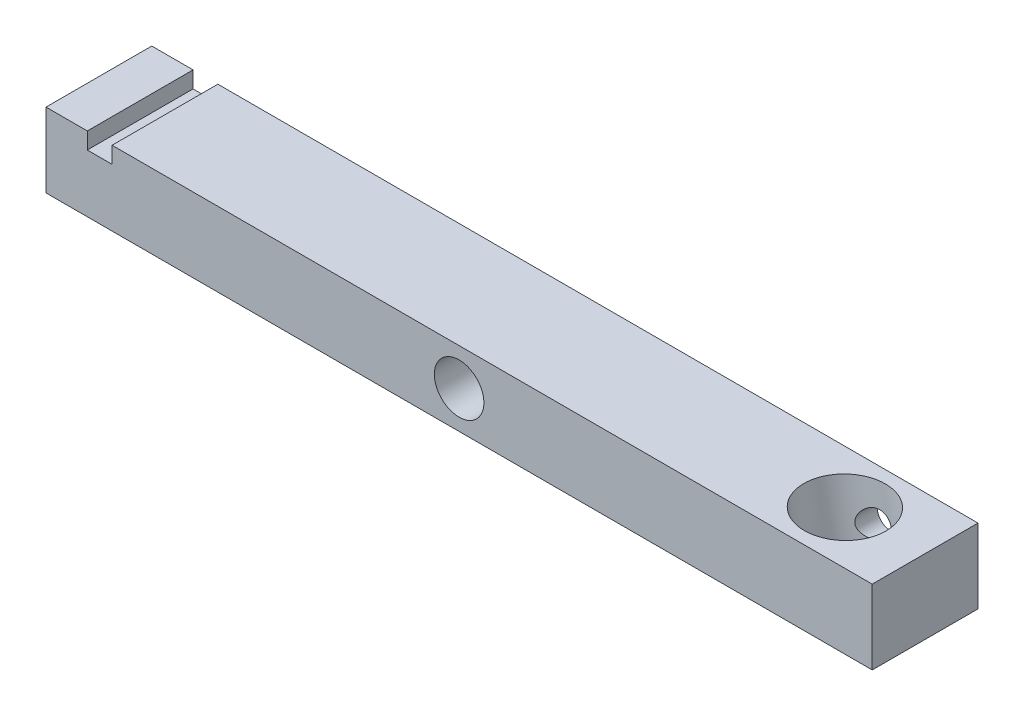
ISO-10303-21;
HEADER;
FILE_DESCRIPTION(('STEP AP214'),'2;1');
FILE_NAME('part.step','',(''),(''),'','','');
FILE_SCHEMA(('AUTOMOTIVE_DESIGN { 1 0 10303 214 1 1 1 1 }'));
ENDSEC;
DATA;
#1=APPLICATION_CONTEXT('core data for automotive mechanical design processes');
#2=APPLICATION_PROTOCOL_DEFINITION('international standard','automotive_design',2000,#1);
#3=PRODUCT_CONTEXT('',#1,'mechanical');
#4=PRODUCT('Part','Part','',(#3));
#5=PRODUCT_RELATED_PRODUCT_CATEGORY('part','',(#4));
#6=PRODUCT_DEFINITION_FORMATION('','',#4);
#7=PRODUCT_DEFINITION_CONTEXT('part definition',#1,'design');
#8=PRODUCT_DEFINITION('design','',#6,#7);
#9=PRODUCT_DEFINITION_SHAPE('','',#8);
#10=(LENGTH_UNIT() NAMED_UNIT(*) SI_UNIT(.MILLI.,.METRE.));
#11=(NAMED_UNIT(*) PLANE_ANGLE_UNIT() SI_UNIT($,.RADIAN.));
#12=(NAMED_UNIT(*) SI_UNIT($,.STERADIAN.) SOLID_ANGLE_UNIT());
#13=UNCERTAINTY_MEASURE_WITH_UNIT(LENGTH_MEASURE(1.E-05),#10,'distance_accuracy_value','');
#14=(GEOMETRIC_REPRESENTATION_CONTEXT(3) GLOBAL_UNCERTAINTY_ASSIGNED_CONTEXT((#13)) GLOBAL_UNIT_ASSIGNED_CONTEXT((#10,
#11,#12)) REPRESENTATION_CONTEXT('',''));
#15=CARTESIAN_POINT('',(0.,0.,0.));
#16=DIRECTION('',(0.,0.,1.));
#17=DIRECTION('',(1.,0.,0.));
#18=AXIS2_PLACEMENT_3D('',#15,#16,#17);
#19=CARTESIAN_POINT('',(-63.5,5.715,8.128));
#20=DIRECTION('',(0.,-1.,0.));
#21=DIRECTION('',(0.,0.,-1.));
#22=AXIS2_PLACEMENT_3D('',#19,#20,#21);
#23=PLANE('',#22);
#24=CARTESIAN_POINT('',(51.1678482337431,5.715,0.));
#25=DIRECTION('',(0.,-1.,0.));
#26=DIRECTION('',(1.,0.,0.));
#27=AXIS2_PLACEMENT_3D('',#24,#25,#26);
#28=ELLIPSE('',#27,6.31899980576499,6.223);
#29=CARTESIAN_POINT('',(57.4868480395081,5.715,0.));
#30=VERTEX_POINT('',#29);
#31=EDGE_CURVE('E239',#30,#30,#28,.T.);
#32=ORIENTED_EDGE('',*,*,#31,.T.);
#33=EDGE_LOOP('',(#32));
#34=FACE_BOUND('',#33,.T.);
#35=DIRECTION('',(-1.,0.,0.));
#36=VECTOR('',#35,1.);
#37=CARTESIAN_POINT('',(-63.5,5.715,-8.128));
#38=LINE('',#37,#36);
#39=CARTESIAN_POINT('',(63.5,5.715,-8.128));
#40=VERTEX_POINT('',#39);
#41=CARTESIAN_POINT('',(-53.34,5.715,-8.128));
#42=VERTEX_POINT('',#41);
#43=EDGE_CURVE('E173',#40,#42,#38,.T.);
#44=ORIENTED_EDGE('',*,*,#43,.T.);
#45=DIRECTION('',(0.,0.,1.));
#46=VECTOR('',#45,1.);
#47=CARTESIAN_POINT('',(-53.34,5.715,-12.7070501198393));
#48=LINE('',#47,#46);
#49=CARTESIAN_POINT('',(-53.34,5.715,8.128));
#50=VERTEX_POINT('',#49);
#51=EDGE_CURVE('E120',#42,#50,#48,.T.);
#52=ORIENTED_EDGE('',*,*,#51,.T.);
#53=DIRECTION('',(-1.,0.,0.));
#54=VECTOR('',#53,1.);
#55=CARTESIAN_POINT('',(-63.5,5.715,8.128));
#56=LINE('',#55,#54);
#57=CARTESIAN_POINT('',(63.5,5.715,8.128));
#58=VERTEX_POINT('',#57);
#59=EDGE_CURVE('E93',#58,#50,#56,.T.);
#60=ORIENTED_EDGE('',*,*,#59,.F.);
#61=DIRECTION('',(0.,0.,-1.));
#62=VECTOR('',#61,1.);
#63=CARTESIAN_POINT('',(63.5,5.715,8.128));
#64=LINE('',#63,#62);
#65=EDGE_CURVE('E11',#58,#40,#64,.T.);
#66=ORIENTED_EDGE('',*,*,#65,.T.);
#67=EDGE_LOOP('',(#44,#52,#60,#66));
#68=FACE_BOUND('',#67,.T.);
#69=ADVANCED_FACE('F39',(#34,#68),#23,.F.);
#70=CARTESIAN_POINT('',(63.5,-5.715,8.128));
#71=DIRECTION('',(-1.,0.,0.));
#72=DIRECTION('',(0.,0.,1.));
#73=AXIS2_PLACEMENT_3D('',#70,#71,#72);
#74=PLANE('',#73);
#75=DIRECTION('',(0.,1.,0.));
#76=VECTOR('',#75,1.);
#77=CARTESIAN_POINT('',(63.5,-5.715,-8.128));
#78=LINE('',#77,#76);
#79=CARTESIAN_POINT('',(63.5,-5.715,-8.128));
#80=VERTEX_POINT('',#79);
#81=EDGE_CURVE('E156',#80,#40,#78,.T.);
#82=ORIENTED_EDGE('',*,*,#81,.T.);
#83=ORIENTED_EDGE('',*,*,#65,.F.);
#84=DIRECTION('',(0.,1.,0.));
#85=VECTOR('',#84,1.);
#86=CARTESIAN_POINT('',(63.5,-5.715,8.128));
#87=LINE('',#86,#85);
#88=CARTESIAN_POINT('',(63.5,-5.715,8.128));
#89=VERTEX_POINT('',#88);
#90=EDGE_CURVE('E157',#89,#58,#87,.T.);
#91=ORIENTED_EDGE('',*,*,#90,.F.);
#92=DIRECTION('',(0.,0.,-1.));
#93=VECTOR('',#92,1.);
#94=CARTESIAN_POINT('',(63.5,-5.715,8.128));
#95=LINE('',#94,#93);
#96=EDGE_CURVE('E168',#89,#80,#95,.T.);
#97=ORIENTED_EDGE('',*,*,#96,.T.);
#98=EDGE_LOOP('',(#82,#83,#91,#97));
#99=FACE_BOUND('',#98,.T.);
#100=ADVANCED_FACE('F41',(#99),#74,.F.);
#101=CARTESIAN_POINT('',(-57.15,5.715,8.128));
#102=VERTEX_POINT('',#101);
#103=CARTESIAN_POINT('',(-63.5,5.715,8.128));
#104=VERTEX_POINT('',#103);
#105=EDGE_CURVE('E160',#102,#104,#56,.T.);
#106=ORIENTED_EDGE('',*,*,#105,.F.);
#107=DIRECTION('',(0.,0.,1.));
#108=VECTOR('',#107,1.);
#109=CARTESIAN_POINT('',(-57.15,5.715,-12.7070501198393));
#110=LINE('',#109,#108);
#111=CARTESIAN_POINT('',(-57.15,5.715,-8.128));
#112=VERTEX_POINT('',#111);
#113=EDGE_CURVE('E148',#112,#102,#110,.T.);
#114=ORIENTED_EDGE('',*,*,#113,.F.);
#115=CARTESIAN_POINT('',(-63.5,5.715,-8.128));
#116=VERTEX_POINT('',#115);
#117=EDGE_CURVE('E172',#112,#116,#38,.T.);
#118=ORIENTED_EDGE('',*,*,#117,.T.);
#119=DIRECTION('',(0.,0.,-1.));
#120=VECTOR('',#119,1.);
#121=CARTESIAN_POINT('',(-63.5,5.715,8.128));
#122=LINE('',#121,#120);
#123=EDGE_CURVE('E49',#104,#116,#122,.T.);
#124=ORIENTED_EDGE('',*,*,#123,.F.);
#125=EDGE_LOOP('',(#106,#114,#118,#124));
#126=FACE_BOUND('',#125,.T.);
#127=ADVANCED_FACE('F211',(#126),#23,.F.);
#128=CARTESIAN_POINT('',(-63.5,-5.715,8.128));
#129=DIRECTION('',(1.,0.,0.));
#130=DIRECTION('',(0.,0.,-1.));
#131=AXIS2_PLACEMENT_3D('',#128,#129,#130);
#132=PLANE('',#131);
#133=DIRECTION('',(0.,-1.,0.));
#134=VECTOR('',#133,1.);
#135=CARTESIAN_POINT('',(-63.5,-5.715,-8.128));
#136=LINE('',#135,#134);
#137=CARTESIAN_POINT('',(-63.5,-5.715,-8.128));
#138=VERTEX_POINT('',#137);
#139=EDGE_CURVE('E176',#116,#138,#136,.T.);
#140=ORIENTED_EDGE('',*,*,#139,.T.);
#141=DIRECTION('',(0.,0.,-1.));
#142=VECTOR('',#141,1.);
#143=CARTESIAN_POINT('',(-63.5,-5.715,8.128));
#144=LINE('',#143,#142);
#145=CARTESIAN_POINT('',(-63.5,-5.715,8.128));
#146=VERTEX_POINT('',#145);
#147=EDGE_CURVE('E183',#146,#138,#144,.T.);
#148=ORIENTED_EDGE('',*,*,#147,.F.);
#149=DIRECTION('',(0.,-1.,0.));
#150=VECTOR('',#149,1.);
#151=CARTESIAN_POINT('',(-63.5,-5.715,8.128));
#152=LINE('',#151,#150);
#153=EDGE_CURVE('E163',#104,#146,#152,.T.);
#154=ORIENTED_EDGE('',*,*,#153,.F.);
#155=ORIENTED_EDGE('',*,*,#123,.T.);
#156=EDGE_LOOP('',(#140,#148,#154,#155));
#157=FACE_BOUND('',#156,.T.);
#158=ADVANCED_FACE('F192',(#157),#132,.F.);
#159=CARTESIAN_POINT('',(-63.5,-5.715,8.128));
#160=DIRECTION('',(0.,1.,0.));
#161=DIRECTION('',(0.,0.,1.));
#162=AXIS2_PLACEMENT_3D('',#159,#160,#161);
#163=PLANE('',#162);
#164=CARTESIAN_POINT('',(53.1832656232408,-5.715,0.));
#165=DIRECTION('',(0.,1.,0.));
#166=DIRECTION('',(1.,0.,0.));
#167=AXIS2_PLACEMENT_3D('',#164,#165,#166);
#168=ELLIPSE('',#167,6.31899980576499,6.223);
#169=CARTESIAN_POINT('',(59.5022654290058,-5.715,0.));
#170=VERTEX_POINT('',#169);
#171=EDGE_CURVE('E43',#170,#170,#168,.T.);
#172=ORIENTED_EDGE('',*,*,#171,.T.);
#173=EDGE_LOOP('',(#172));
#174=FACE_BOUND('',#173,.T.);
#175=DIRECTION('',(1.,0.,0.));
#176=VECTOR('',#175,1.);
#177=CARTESIAN_POINT('',(-63.5,-5.715,-8.128));
#178=LINE('',#177,#176);
#179=EDGE_CURVE('E86',#138,#80,#178,.T.);
#180=ORIENTED_EDGE('',*,*,#179,.T.);
#181=ORIENTED_EDGE('',*,*,#96,.F.);
#182=DIRECTION('',(1.,0.,0.));
#183=VECTOR('',#182,1.);
#184=CARTESIAN_POINT('',(-63.5,-5.715,8.128));
#185=LINE('',#184,#183);
#186=EDGE_CURVE('E65',#146,#89,#185,.T.);
#187=ORIENTED_EDGE('',*,*,#186,.F.);
#188=ORIENTED_EDGE('',*,*,#147,.T.);
#189=EDGE_LOOP('',(#180,#181,#187,#188));
#190=FACE_BOUND('',#189,.T.);
#191=ADVANCED_FACE('F200',(#174,#190),#163,.F.);
#192=CARTESIAN_POINT('',(0.,0.,8.128));
#193=DIRECTION('',(0.,0.,-1.));
#194=DIRECTION('',(-1.,0.,0.));
#195=AXIS2_PLACEMENT_3D('',#192,#193,#194);
#196=PLANE('',#195);
#197=CARTESIAN_POINT('',(0.,0.,8.128));
#198=DIRECTION('',(0.,0.,1.));
#199=DIRECTION('',(1.,0.,0.));
#200=AXIS2_PLACEMENT_3D('',#197,#198,#199);
#201=CIRCLE('',#200,3.81);
#202=CARTESIAN_POINT('',(3.81,0.,8.128));
#203=VERTEX_POINT('',#202);
#204=EDGE_CURVE('E233',#203,#203,#201,.T.);
#205=ORIENTED_EDGE('',*,*,#204,.F.);
#206=EDGE_LOOP('',(#205));
#207=FACE_BOUND('',#206,.T.);
#208=ORIENTED_EDGE('',*,*,#59,.T.);
#209=DIRECTION('',(0.,1.,0.));
#210=VECTOR('',#209,1.);
#211=CARTESIAN_POINT('',(-53.34,3.175,8.128));
#212=LINE('',#211,#210);
#213=CARTESIAN_POINT('',(-53.34,3.175,8.128));
#214=VERTEX_POINT('',#213);
#215=EDGE_CURVE('E139',#214,#50,#212,.T.);
#216=ORIENTED_EDGE('',*,*,#215,.F.);
#217=DIRECTION('',(1.,0.,0.));
#218=VECTOR('',#217,1.);
#219=CARTESIAN_POINT('',(-57.15,3.175,8.128));
#220=LINE('',#219,#218);
#221=CARTESIAN_POINT('',(-57.15,3.175,8.128));
#222=VERTEX_POINT('',#221);
#223=EDGE_CURVE('E131',#222,#214,#220,.T.);
#224=ORIENTED_EDGE('',*,*,#223,.F.);
#225=DIRECTION('',(0.,-1.,0.));
#226=VECTOR('',#225,1.);
#227=CARTESIAN_POINT('',(-57.15,5.715,8.128));
#228=LINE('',#227,#226);
#229=EDGE_CURVE('E145',#102,#222,#228,.T.);
#230=ORIENTED_EDGE('',*,*,#229,.F.);
#231=ORIENTED_EDGE('',*,*,#105,.T.);
#232=ORIENTED_EDGE('',*,*,#153,.T.);
#233=ORIENTED_EDGE('',*,*,#186,.T.);
#234=ORIENTED_EDGE('',*,*,#90,.T.);
#235=EDGE_LOOP('',(#208,#216,#224,#230,#231,#232,#233,#234));
#236=FACE_BOUND('',#235,.T.);
#237=ADVANCED_FACE('F202',(#207,#236),#196,.F.);
#238=CARTESIAN_POINT('',(0.,0.,-8.128));
#239=DIRECTION('',(0.,0.,-1.));
#240=DIRECTION('',(-1.,0.,0.));
#241=AXIS2_PLACEMENT_3D('',#238,#239,#240);
#242=PLANE('',#241);
#243=CARTESIAN_POINT('',(50.0486206681836,0.,-8.128));
#244=DIRECTION('',(0.,0.,-1.));
#245=DIRECTION('',(-1.,0.,0.));
#246=AXIS2_PLACEMENT_3D('',#243,#244,#245);
#247=CIRCLE('',#246,2.032);
#248=CARTESIAN_POINT('',(48.0166206681836,0.,-8.128));
#249=VERTEX_POINT('',#248);
#250=EDGE_CURVE('E253',#249,#249,#247,.T.);
#251=ORIENTED_EDGE('',*,*,#250,.F.);
#252=EDGE_LOOP('',(#251));
#253=FACE_BOUND('',#252,.T.);
#254=CARTESIAN_POINT('',(0.,0.,-8.128));
#255=DIRECTION('',(0.,0.,-1.));
#256=DIRECTION('',(-1.,0.,0.));
#257=AXIS2_PLACEMENT_3D('',#254,#255,#256);
#258=CIRCLE('',#257,3.81);
#259=CARTESIAN_POINT('',(-3.81,0.,-8.128));
#260=VERTEX_POINT('',#259);
#261=EDGE_CURVE('E229',#260,#260,#258,.F.);
#262=ORIENTED_EDGE('',*,*,#261,.T.);
#263=EDGE_LOOP('',(#262));
#264=FACE_BOUND('',#263,.T.);
#265=DIRECTION('',(0.,1.,0.));
#266=VECTOR('',#265,1.);
#267=CARTESIAN_POINT('',(-53.34,3.175,-8.128));
#268=LINE('',#267,#266);
#269=CARTESIAN_POINT('',(-53.34,3.175,-8.128));
#270=VERTEX_POINT('',#269);
#271=EDGE_CURVE('E115',#270,#42,#268,.T.);
#272=ORIENTED_EDGE('',*,*,#271,.T.);
#273=ORIENTED_EDGE('',*,*,#43,.F.);
#274=ORIENTED_EDGE('',*,*,#81,.F.);
#275=ORIENTED_EDGE('',*,*,#179,.F.);
#276=ORIENTED_EDGE('',*,*,#139,.F.);
#277=ORIENTED_EDGE('',*,*,#117,.F.);
#278=DIRECTION('',(0.,-1.,0.));
#279=VECTOR('',#278,1.);
#280=CARTESIAN_POINT('',(-57.15,5.715,-8.128));
#281=LINE('',#280,#279);
#282=CARTESIAN_POINT('',(-57.15,3.175,-8.128));
#283=VERTEX_POINT('',#282);
#284=EDGE_CURVE('E137',#112,#283,#281,.T.);
#285=ORIENTED_EDGE('',*,*,#284,.T.);
#286=DIRECTION('',(1.,0.,0.));
#287=VECTOR('',#286,1.);
#288=CARTESIAN_POINT('',(-57.15,3.175,-8.128));
#289=LINE('',#288,#287);
#290=EDGE_CURVE('E128',#283,#270,#289,.T.);
#291=ORIENTED_EDGE('',*,*,#290,.T.);
#292=EDGE_LOOP('',(#272,#273,#274,#275,#276,#277,#285,#291));
#293=FACE_BOUND('',#292,.T.);
#294=ADVANCED_FACE('F135',(#253,#264,#293),#242,.T.);
#295=CARTESIAN_POINT('',(-57.15,3.175,-12.7070501198393));
#296=DIRECTION('',(0.,-1.,0.));
#297=DIRECTION('',(0.,0.,-1.));
#298=AXIS2_PLACEMENT_3D('',#295,#296,#297);
#299=PLANE('',#298);
#300=DIRECTION('',(0.,0.,1.));
#301=VECTOR('',#300,1.);
#302=CARTESIAN_POINT('',(-57.15,3.175,-12.7070501198393));
#303=LINE('',#302,#301);
#304=EDGE_CURVE('E56',#283,#222,#303,.T.);
#305=ORIENTED_EDGE('',*,*,#304,.T.);
#306=ORIENTED_EDGE('',*,*,#223,.T.);
#307=DIRECTION('',(0.,0.,1.));
#308=VECTOR('',#307,1.);
#309=CARTESIAN_POINT('',(-53.34,3.175,-12.7070501198393));
#310=LINE('',#309,#308);
#311=EDGE_CURVE('E118',#270,#214,#310,.T.);
#312=ORIENTED_EDGE('',*,*,#311,.F.);
#313=ORIENTED_EDGE('',*,*,#290,.F.);
#314=EDGE_LOOP('',(#305,#306,#312,#313));
#315=FACE_BOUND('',#314,.T.);
#316=ADVANCED_FACE('F127',(#315),#299,.F.);
#317=CARTESIAN_POINT('',(-53.34,3.175,-12.7070501198393));
#318=DIRECTION('',(1.,0.,0.));
#319=DIRECTION('',(0.,0.,-1.));
#320=AXIS2_PLACEMENT_3D('',#317,#318,#319);
#321=PLANE('',#320);
#322=ORIENTED_EDGE('',*,*,#311,.T.);
#323=ORIENTED_EDGE('',*,*,#215,.T.);
#324=ORIENTED_EDGE('',*,*,#51,.F.);
#325=ORIENTED_EDGE('',*,*,#271,.F.);
#326=EDGE_LOOP('',(#322,#323,#324,#325));
#327=FACE_BOUND('',#326,.T.);
#328=ADVANCED_FACE('F117',(#327),#321,.F.);
#329=CARTESIAN_POINT('',(-57.15,5.715,-12.7070501198393));
#330=DIRECTION('',(-1.,0.,0.));
#331=DIRECTION('',(0.,0.,1.));
#332=AXIS2_PLACEMENT_3D('',#329,#330,#331);
#333=PLANE('',#332);
#334=ORIENTED_EDGE('',*,*,#113,.T.);
#335=ORIENTED_EDGE('',*,*,#229,.T.);
#336=ORIENTED_EDGE('',*,*,#304,.F.);
#337=ORIENTED_EDGE('',*,*,#284,.F.);
#338=EDGE_LOOP('',(#334,#335,#336,#337));
#339=FACE_BOUND('',#338,.T.);
#340=ADVANCED_FACE('F267',(#339),#333,.F.);
#341=CARTESIAN_POINT('',(0.,0.,-18.904307345283));
#342=DIRECTION('',(0.,0.,1.));
#343=DIRECTION('',(1.,0.,0.));
#344=AXIS2_PLACEMENT_3D('',#341,#342,#343);
#345=CYLINDRICAL_SURFACE('',#344,3.81);
#346=ORIENTED_EDGE('',*,*,#204,.T.);
#347=EDGE_LOOP('',(#346));
#348=FACE_BOUND('',#347,.T.);
#349=ORIENTED_EDGE('',*,*,#261,.F.);
#350=EDGE_LOOP('',(#349));
#351=FACE_BOUND('',#350,.T.);
#352=ADVANCED_FACE('F263',(#348,#351),#345,.F.);
#353=CARTESIAN_POINT('',(49.0836895166559,17.5348514414141,0.));
#354=DIRECTION('',(0.173648177666931,-0.984807753012208,0.));
#355=DIRECTION('',(0.984807753012208,0.173648177666931,0.));
#356=AXIS2_PLACEMENT_3D('',#353,#354,#355);
#357=CYLINDRICAL_SURFACE('',#356,6.223);
#358=CARTESIAN_POINT('',(48.0166206681836,0.,-4.68514023675362));
#359=CARTESIAN_POINT('',(48.0166302239781,-0.0886860710956889,-4.67168847129592));
#360=CARTESIAN_POINT('',(48.0224676987821,-0.17822752146924,-4.66300114271461));
#361=CARTESIAN_POINT('',(48.0460712057827,-0.356237417448257,-4.65621519276301));
#362=CARTESIAN_POINT('',(48.0638552626371,-0.444704035737483,-4.65813260318254));
#363=CARTESIAN_POINT('',(48.1106455851768,-0.617465029147635,-4.67232586492912));
#364=CARTESIAN_POINT('',(48.1396208976008,-0.701770195133147,-4.68457325479416));
#365=CARTESIAN_POINT('',(48.2075012781615,-0.864340370727577,-4.71806300295546));
#366=CARTESIAN_POINT('',(48.2464121137885,-0.942601837533783,-4.73931059052968));
#367=CARTESIAN_POINT('',(48.3445035076539,-1.11222923976855,-4.79573439085082));
#368=CARTESIAN_POINT('',(48.4063172735646,-1.20132677389375,-4.83313058623487));
#369=CARTESIAN_POINT('',(48.5410284947616,-1.36660118628935,-4.91564301640467));
#370=CARTESIAN_POINT('',(48.613940936094,-1.44276029564435,-4.96076969981262));
#371=CARTESIAN_POINT('',(48.7701134959652,-1.58291573437983,-5.0562559522483));
#372=CARTESIAN_POINT('',(48.8535210032725,-1.64669706636949,-5.10668792733931));
#373=CARTESIAN_POINT('',(49.0282120137202,-1.76029851479009,-5.20948947031477));
#374=CARTESIAN_POINT('',(49.119495856793,-1.81011802825259,-5.26185912177104));
#375=CARTESIAN_POINT('',(49.3277494067045,-1.90391495101076,-5.37690031620424));
#376=CARTESIAN_POINT('',(49.4461958159031,-1.94470957826416,-5.43952851387954));
#377=CARTESIAN_POINT('',(49.6903462676683,-2.00410707287018,-5.5613000258346));
#378=CARTESIAN_POINT('',(49.8160534875968,-2.02270014640313,-5.62044179120911));
#379=CARTESIAN_POINT('',(50.0711752028102,-2.03586991323917,-5.73228603377547));
#380=CARTESIAN_POINT('',(50.2005771251149,-2.03052019823482,-5.78500773149169));
#381=CARTESIAN_POINT('',(50.4590269213108,-1.99438281643546,-5.88188445976089));
#382=CARTESIAN_POINT('',(50.5880750261039,-1.96362244810971,-5.92604862077999));
#383=CARTESIAN_POINT('',(50.8257795237951,-1.88122583494654,-5.99986910151565));
#384=CARTESIAN_POINT('',(50.9350741447999,-1.8323975958051,-6.03060982571293));
#385=CARTESIAN_POINT('',(51.1447827192729,-1.71518350923357,-6.08403206331901));
#386=CARTESIAN_POINT('',(51.2452010972318,-1.64680747847747,-6.10671760915636));
#387=CARTESIAN_POINT('',(51.4249291016483,-1.49905401755439,-6.14299372538966));
#388=CARTESIAN_POINT('',(51.5053106103939,-1.42112383995489,-6.15719763562715));
#389=CARTESIAN_POINT('',(51.6524753017407,-1.252668018183,-6.18034520388579));
#390=CARTESIAN_POINT('',(51.7192596008145,-1.16214340917288,-6.18928929390693));
#391=CARTESIAN_POINT('',(51.8364099376532,-0.972188300004429,-6.20309710168317));
#392=CARTESIAN_POINT('',(51.8869527445445,-0.872869826922434,-6.20800572586638));
#393=CARTESIAN_POINT('',(51.9711641386432,-0.667231183264753,-6.21519808345749));
#394=CARTESIAN_POINT('',(52.004831475074,-0.560910494359189,-6.21748162231545));
#395=CARTESIAN_POINT('',(52.0547827337807,-0.342251219949268,-6.22059968865595));
#396=CARTESIAN_POINT('',(52.070747745289,-0.229839344911605,-6.22140779749539));
#397=CARTESIAN_POINT('',(52.0837650404807,-0.00392204202035201,-6.22238838105553));
#398=CARTESIAN_POINT('',(52.0808164447427,0.109583436437238,-6.22256082621933));
#399=CARTESIAN_POINT('',(52.0559759065612,0.335528445881936,-6.22272024550084));
#400=CARTESIAN_POINT('',(52.0339157762853,0.447949527650132,-6.22270555700739));
#401=CARTESIAN_POINT('',(51.9712491923037,0.667500554053905,-6.2224263354673));
#402=CARTESIAN_POINT('',(51.9306421237767,0.77463032315479,-6.22216179413786));
#403=CARTESIAN_POINT('',(51.8319976265453,0.980633324650843,-6.22080555205004));
#404=CARTESIAN_POINT('',(51.7739474349643,1.07950044345373,-6.21971324473372));
#405=CARTESIAN_POINT('',(51.6420905854393,1.26606656049938,-6.21568644588802));
#406=CARTESIAN_POINT('',(51.5682839396998,1.3537655673925,-6.21275195578554));
#407=CARTESIAN_POINT('',(51.4073988173672,1.51514906908323,-6.20375218230575));
#408=CARTESIAN_POINT('',(51.3203724749605,1.58888616550977,-6.19769898313723));
#409=CARTESIAN_POINT('',(51.1355174615893,1.72062630351214,-6.1810862060853));
#410=CARTESIAN_POINT('',(51.0376906516556,1.77863204982454,-6.1705274036677));
#411=CARTESIAN_POINT('',(50.8360447226349,1.87652434865113,-6.14388628133971));
#412=CARTESIAN_POINT('',(50.7323489974028,1.91669035082648,-6.12789662600687));
#413=CARTESIAN_POINT('',(50.5209114843616,1.97942511674869,-6.08954648819417));
#414=CARTESIAN_POINT('',(50.4131702165709,2.00199613411234,-6.06718682210489));
#415=CARTESIAN_POINT('',(50.1979515215388,2.02938373790803,-6.01601819553922));
#416=CARTESIAN_POINT('',(50.0904793178382,2.03434602994893,-5.98726426483021));
#417=CARTESIAN_POINT('',(49.8779708478505,2.02761271430681,-5.92346824221998));
#418=CARTESIAN_POINT('',(49.7729350743798,2.01591376590653,-5.88842489046894));
#419=CARTESIAN_POINT('',(49.5633807980267,1.97621719449893,-5.81113236641194));
#420=CARTESIAN_POINT('',(49.4590862398049,1.9475284738117,-5.76863489996373));
#421=CARTESIAN_POINT('',(49.2581533816654,1.87499572851043,-5.67883168078124));
#422=CARTESIAN_POINT('',(49.1615174075926,1.83114712148685,-5.6315244772537));
#423=CARTESIAN_POINT('',(48.9679532401924,1.72470618076011,-5.52852689153946));
#424=CARTESIAN_POINT('',(48.8720253489256,1.66064587021189,-5.47247528728727));
#425=CARTESIAN_POINT('',(48.6928443647704,1.51790568654681,-5.35856112183405));
#426=CARTESIAN_POINT('',(48.6096049181981,1.43921027256528,-5.30069669043671));
#427=CARTESIAN_POINT('',(48.4493574070461,1.25988166597907,-5.17990572784771));
#428=CARTESIAN_POINT('',(48.373865076011,1.15782602726053,-5.11706899463616));
#429=CARTESIAN_POINT('',(48.2421054621703,0.939040603782388,-4.99675713995996));
#430=CARTESIAN_POINT('',(48.1858263946387,0.822319874389953,-4.93927874766724));
#431=CARTESIAN_POINT('',(48.107753399388,0.609288503505984,-4.84952759295624));
#432=CARTESIAN_POINT('',(48.0807507872462,0.515980674830851,-4.81464011465949));
#433=CARTESIAN_POINT('',(48.0402280678995,0.323920077275776,-4.75370348523093));
#434=CARTESIAN_POINT('',(48.0266525957003,0.225191454508083,-4.72761833478061));
#435=CARTESIAN_POINT('',(48.0179104574129,0.0835433453490724,-4.69890267958523));
#436=CARTESIAN_POINT('',(48.0166161570769,0.0418669876911111,-4.69149055639101));
#437=CARTESIAN_POINT('',(48.0166206681836,0.,-4.68514023675362));
#438=B_SPLINE_CURVE_WITH_KNOTS('',3,(#358,#359,#360,#361,#362,#363,#364,#365,#366,#367,#368,
#369,#370,#371,#372,#373,#374,#375,#376,#377,#378,#379,#380,#381,#382,#383,#384,#385,#386,#387,
#388,#389,#390,#391,#392,#393,#394,#395,#396,#397,#398,#399,#400,#401,#402,#403,#404,#405,#406,
#407,#408,#409,#410,#411,#412,#413,#414,#415,#416,#417,#418,#419,#420,#421,#422,#423,#424,#425,
#426,#427,#428,#429,#430,#431,#432,#433,#434,#435,#436,#437),.UNSPECIFIED.,.T.,.F.,(4,2,2,2,2,2,
2,2,2,2,2,2,2,2,2,2,2,2,2,2,2,2,2,2,2,2,2,2,2,2,2,2,2,2,2,2,2,2,2,4),(0.,0.268961294679523,
0.538329304547136,0.806957559068222,1.07574210602295,1.41802420066425,1.76077263179184,
2.10902606990227,2.45729454570177,2.87550789884244,3.29390567127375,3.71101832112141,
4.12768345191091,4.4964250264323,4.86498174752365,5.20191674329691,5.53882406203071,
5.87192951475894,6.20505965295795,6.54409832975761,6.88315277087187,7.22522166646472,
7.5673019022841,7.90963304519115,8.2519639229414,8.59297822092024,8.93393385009962,
9.26934202096771,9.60470722472079,9.93729085102928,10.2699411725102,10.6171541616095,
10.9644721953748,11.3476557590239,11.7312485690841,12.1542005037501,12.5768925468221,
12.8854121752252,13.1926542941423,13.3196257460807),.UNSPECIFIED.);
#439=CARTESIAN_POINT('',(48.0166206681836,0.,-4.68514023675362));
#440=VERTEX_POINT('',#439);
#441=EDGE_CURVE('E244',#440,#440,#438,.T.);
#442=ORIENTED_EDGE('',*,*,#441,.F.);
#443=EDGE_LOOP('',(#442));
#444=FACE_BOUND('',#443,.T.);
#445=ORIENTED_EDGE('',*,*,#171,.F.);
#446=EDGE_LOOP('',(#445));
#447=FACE_BOUND('',#446,.T.);
#448=ORIENTED_EDGE('',*,*,#31,.F.);
#449=EDGE_LOOP('',(#448));
#450=FACE_BOUND('',#449,.T.);
#451=ADVANCED_FACE('F259',(#444,#447,#450),#357,.F.);
#452=CARTESIAN_POINT('',(50.0486206681836,0.,8.129));
#453=DIRECTION('',(0.,0.,-1.));
#454=DIRECTION('',(-1.,0.,0.));
#455=AXIS2_PLACEMENT_3D('',#452,#453,#454);
#456=CYLINDRICAL_SURFACE('',#455,2.032);
#457=ORIENTED_EDGE('',*,*,#441,.T.);
#458=EDGE_LOOP('',(#457));
#459=FACE_BOUND('',#458,.T.);
#460=ORIENTED_EDGE('',*,*,#250,.T.);
#461=EDGE_LOOP('',(#460));
#462=FACE_BOUND('',#461,.T.);
#463=ADVANCED_FACE('F254',(#459,#462),#456,.F.);
#464=CLOSED_SHELL('',(#69,#100,#127,#158,#191,#237,#294,#316,#328,#340,#352,#451,#463));
#465=MANIFOLD_SOLID_BREP('B2',#464);
#466=ADVANCED_BREP_SHAPE_REPRESENTATION('',(#18,#465),#14);
#467=SHAPE_DEFINITION_REPRESENTATION(#9,#466);
ENDSEC;
END-ISO-10303-21;
